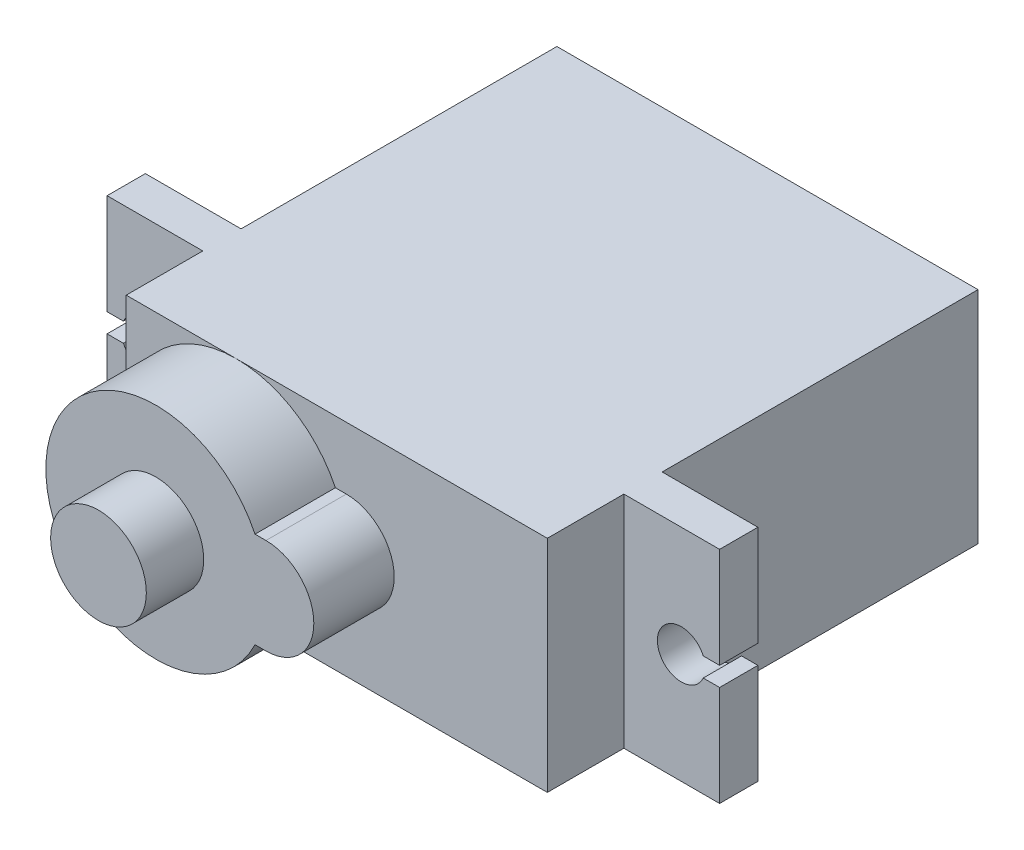
ISO-10303-21;
HEADER;
FILE_DESCRIPTION(('STEP AP214'),'2;1');
FILE_NAME('part.step','',(''),(''),'','','');
FILE_SCHEMA(('AUTOMOTIVE_DESIGN { 1 0 10303 214 1 1 1 1 }'));
ENDSEC;
DATA;
#1=APPLICATION_CONTEXT('core data for automotive mechanical design processes');
#2=APPLICATION_PROTOCOL_DEFINITION('international standard','automotive_design',2000,#1);
#3=PRODUCT_CONTEXT('',#1,'mechanical');
#4=PRODUCT('Part','Part','',(#3));
#5=PRODUCT_RELATED_PRODUCT_CATEGORY('part','',(#4));
#6=PRODUCT_DEFINITION_FORMATION('','',#4);
#7=PRODUCT_DEFINITION_CONTEXT('part definition',#1,'design');
#8=PRODUCT_DEFINITION('design','',#6,#7);
#9=PRODUCT_DEFINITION_SHAPE('','',#8);
#10=(LENGTH_UNIT() NAMED_UNIT(*) SI_UNIT(.MILLI.,.METRE.));
#11=(NAMED_UNIT(*) PLANE_ANGLE_UNIT() SI_UNIT($,.RADIAN.));
#12=(NAMED_UNIT(*) SI_UNIT($,.STERADIAN.) SOLID_ANGLE_UNIT());
#13=UNCERTAINTY_MEASURE_WITH_UNIT(LENGTH_MEASURE(1.E-05),#10,'distance_accuracy_value','');
#14=(GEOMETRIC_REPRESENTATION_CONTEXT(3) GLOBAL_UNCERTAINTY_ASSIGNED_CONTEXT((#13)) GLOBAL_UNIT_ASSIGNED_CONTEXT((#10,
#11,#12)) REPRESENTATION_CONTEXT('',''));
#15=CARTESIAN_POINT('',(0.,0.,0.));
#16=DIRECTION('',(0.,0.,1.));
#17=DIRECTION('',(1.,0.,0.));
#18=AXIS2_PLACEMENT_3D('',#15,#16,#17);
#19=CARTESIAN_POINT('',(-10.5,5.75,26.7));
#20=DIRECTION('',(0.,0.,-1.));
#21=DIRECTION('',(-1.,0.,0.));
#22=AXIS2_PLACEMENT_3D('',#19,#20,#21);
#23=PLANE('',#22);
#24=CARTESIAN_POINT('',(-10.5,5.75,26.7));
#25=DIRECTION('',(0.,0.,1.));
#26=DIRECTION('',(-1.,0.,0.));
#27=AXIS2_PLACEMENT_3D('',#24,#25,#26);
#28=CIRCLE('',#27,2.5);
#29=CARTESIAN_POINT('',(-10.5,3.25,26.7));
#30=VERTEX_POINT('',#29);
#31=CARTESIAN_POINT('',(-10.5,8.25,26.7));
#32=VERTEX_POINT('',#31);
#33=EDGE_CURVE('E218',#30,#32,#28,.T.);
#34=ORIENTED_EDGE('',*,*,#33,.T.);
#35=DIRECTION('',(-1.,0.,0.));
#36=VECTOR('',#35,1.);
#37=CARTESIAN_POINT('',(-10.5,8.25,26.7));
#38=LINE('',#37,#36);
#39=CARTESIAN_POINT('',(-11.071921205698,8.25,26.7));
#40=VERTEX_POINT('',#39);
#41=EDGE_CURVE('E207',#32,#40,#38,.T.);
#42=ORIENTED_EDGE('',*,*,#41,.T.);
#43=CARTESIAN_POINT('',(-16.25,5.75,26.7));
#44=DIRECTION('',(0.,0.,1.));
#45=DIRECTION('',(1.,0.,0.));
#46=AXIS2_PLACEMENT_3D('',#43,#44,#45);
#47=CIRCLE('',#46,5.75);
#48=CARTESIAN_POINT('',(-11.071921205698,3.25,26.7));
#49=VERTEX_POINT('',#48);
#50=EDGE_CURVE('E217',#40,#49,#47,.T.);
#51=ORIENTED_EDGE('',*,*,#50,.T.);
#52=DIRECTION('',(1.,0.,0.));
#53=VECTOR('',#52,1.);
#54=CARTESIAN_POINT('',(-10.5,3.25,26.7));
#55=LINE('',#54,#53);
#56=EDGE_CURVE('E223',#49,#30,#55,.T.);
#57=ORIENTED_EDGE('',*,*,#56,.T.);
#58=EDGE_LOOP('',(#34,#42,#51,#57));
#59=FACE_BOUND('',#58,.T.);
#60=CARTESIAN_POINT('',(-16.25,5.75,26.7));
#61=DIRECTION('',(0.,0.,-1.));
#62=DIRECTION('',(-1.,0.,0.));
#63=AXIS2_PLACEMENT_3D('',#60,#61,#62);
#64=CIRCLE('',#63,2.5);
#65=CARTESIAN_POINT('',(-18.75,5.75,26.7));
#66=VERTEX_POINT('',#65);
#67=EDGE_CURVE('E11',#66,#66,#64,.F.);
#68=ORIENTED_EDGE('',*,*,#67,.F.);
#69=EDGE_LOOP('',(#68));
#70=FACE_BOUND('',#69,.T.);
#71=ADVANCED_FACE('F39',(#59,#70),#23,.F.);
#72=CARTESIAN_POINT('',(0.,0.,22.5));
#73=DIRECTION('',(0.,0.,1.));
#74=DIRECTION('',(1.,0.,0.));
#75=AXIS2_PLACEMENT_3D('',#72,#73,#74);
#76=PLANE('',#75);
#77=CARTESIAN_POINT('',(-16.25,5.75,22.5));
#78=DIRECTION('',(0.,0.,1.));
#79=DIRECTION('',(1.,0.,0.));
#80=AXIS2_PLACEMENT_3D('',#77,#78,#79);
#81=CIRCLE('',#80,5.75);
#82=CARTESIAN_POINT('',(-22.,5.75,22.5));
#83=VERTEX_POINT('',#82);
#84=CARTESIAN_POINT('',(-16.25,0.,22.5));
#85=VERTEX_POINT('',#84);
#86=EDGE_CURVE('E47',#83,#85,#81,.T.);
#87=ORIENTED_EDGE('',*,*,#86,.F.);
#88=DIRECTION('',(0.,-1.,0.));
#89=VECTOR('',#88,1.);
#90=CARTESIAN_POINT('',(-22.,0.,22.5));
#91=LINE('',#90,#89);
#92=CARTESIAN_POINT('',(-22.,0.,22.5));
#93=VERTEX_POINT('',#92);
#94=EDGE_CURVE('E342',#83,#93,#91,.T.);
#95=ORIENTED_EDGE('',*,*,#94,.T.);
#96=DIRECTION('',(1.,0.,0.));
#97=VECTOR('',#96,1.);
#98=CARTESIAN_POINT('',(0.,0.,22.5));
#99=LINE('',#98,#97);
#100=EDGE_CURVE('E347',#93,#85,#99,.T.);
#101=ORIENTED_EDGE('',*,*,#100,.T.);
#102=EDGE_LOOP('',(#87,#95,#101));
#103=FACE_BOUND('',#102,.T.);
#104=ADVANCED_FACE('F397',(#103),#76,.T.);
#105=CARTESIAN_POINT('',(-11.071921205698,3.25,22.5));
#106=VERTEX_POINT('',#105);
#107=EDGE_CURVE('E383',#85,#106,#81,.T.);
#108=ORIENTED_EDGE('',*,*,#107,.F.);
#109=CARTESIAN_POINT('',(0.,0.,22.5));
#110=VERTEX_POINT('',#109);
#111=EDGE_CURVE('E346',#85,#110,#99,.T.);
#112=ORIENTED_EDGE('',*,*,#111,.T.);
#113=DIRECTION('',(0.,1.,0.));
#114=VECTOR('',#113,1.);
#115=CARTESIAN_POINT('',(0.,0.,22.5));
#116=LINE('',#115,#114);
#117=CARTESIAN_POINT('',(0.,11.5,22.5));
#118=VERTEX_POINT('',#117);
#119=EDGE_CURVE('E334',#110,#118,#116,.T.);
#120=ORIENTED_EDGE('',*,*,#119,.T.);
#121=DIRECTION('',(-1.,0.,0.));
#122=VECTOR('',#121,1.);
#123=CARTESIAN_POINT('',(0.,11.5,22.5));
#124=LINE('',#123,#122);
#125=CARTESIAN_POINT('',(-16.25,11.5,22.5));
#126=VERTEX_POINT('',#125);
#127=EDGE_CURVE('E339',#118,#126,#124,.T.);
#128=ORIENTED_EDGE('',*,*,#127,.T.);
#129=CARTESIAN_POINT('',(-11.071921205698,8.25,22.5));
#130=VERTEX_POINT('',#129);
#131=EDGE_CURVE('E385',#130,#126,#81,.T.);
#132=ORIENTED_EDGE('',*,*,#131,.F.);
#133=DIRECTION('',(-1.,0.,0.));
#134=VECTOR('',#133,1.);
#135=CARTESIAN_POINT('',(-10.5,8.25,22.5));
#136=LINE('',#135,#134);
#137=CARTESIAN_POINT('',(-10.5,8.25,22.5));
#138=VERTEX_POINT('',#137);
#139=EDGE_CURVE('E391',#138,#130,#136,.T.);
#140=ORIENTED_EDGE('',*,*,#139,.F.);
#141=CARTESIAN_POINT('',(-10.5,5.75,22.5));
#142=DIRECTION('',(0.,0.,1.));
#143=DIRECTION('',(-1.,0.,0.));
#144=AXIS2_PLACEMENT_3D('',#141,#142,#143);
#145=CIRCLE('',#144,2.5);
#146=CARTESIAN_POINT('',(-10.5,3.25,22.5));
#147=VERTEX_POINT('',#146);
#148=EDGE_CURVE('E59',#147,#138,#145,.T.);
#149=ORIENTED_EDGE('',*,*,#148,.F.);
#150=DIRECTION('',(1.,0.,0.));
#151=VECTOR('',#150,1.);
#152=CARTESIAN_POINT('',(-10.5,3.25,22.5));
#153=LINE('',#152,#151);
#154=EDGE_CURVE('E54',#106,#147,#153,.T.);
#155=ORIENTED_EDGE('',*,*,#154,.F.);
#156=EDGE_LOOP('',(#108,#112,#120,#128,#132,#140,#149,#155));
#157=FACE_BOUND('',#156,.T.);
#158=ADVANCED_FACE('F419',(#157),#76,.T.);
#159=CARTESIAN_POINT('',(-27.,11.5,16.5));
#160=DIRECTION('',(-1.,0.,0.));
#161=DIRECTION('',(0.,0.,1.));
#162=AXIS2_PLACEMENT_3D('',#159,#160,#161);
#163=PLANE('',#162);
#164=DIRECTION('',(0.,0.,1.));
#165=VECTOR('',#164,1.);
#166=CARTESIAN_POINT('',(-27.,5.25,0.));
#167=LINE('',#166,#165);
#168=CARTESIAN_POINT('',(-27.,5.25,16.5));
#169=VERTEX_POINT('',#168);
#170=CARTESIAN_POINT('',(-27.,5.25,18.5));
#171=VERTEX_POINT('',#170);
#172=EDGE_CURVE('E245',#169,#171,#167,.T.);
#173=ORIENTED_EDGE('',*,*,#172,.F.);
#174=DIRECTION('',(0.,-1.,0.));
#175=VECTOR('',#174,1.);
#176=CARTESIAN_POINT('',(-27.,11.5,16.5));
#177=LINE('',#176,#175);
#178=CARTESIAN_POINT('',(-27.,0.,16.5));
#179=VERTEX_POINT('',#178);
#180=EDGE_CURVE('E286',#169,#179,#177,.T.);
#181=ORIENTED_EDGE('',*,*,#180,.T.);
#182=DIRECTION('',(0.,0.,1.));
#183=VECTOR('',#182,1.);
#184=CARTESIAN_POINT('',(-27.,0.,16.5));
#185=LINE('',#184,#183);
#186=CARTESIAN_POINT('',(-27.,0.,18.5));
#187=VERTEX_POINT('',#186);
#188=EDGE_CURVE('E298',#179,#187,#185,.T.);
#189=ORIENTED_EDGE('',*,*,#188,.T.);
#190=DIRECTION('',(0.,-1.,0.));
#191=VECTOR('',#190,1.);
#192=CARTESIAN_POINT('',(-27.,11.5,18.5));
#193=LINE('',#192,#191);
#194=EDGE_CURVE('E281',#171,#187,#193,.T.);
#195=ORIENTED_EDGE('',*,*,#194,.F.);
#196=EDGE_LOOP('',(#173,#181,#189,#195));
#197=FACE_BOUND('',#196,.T.);
#198=ADVANCED_FACE('F459',(#197),#163,.T.);
#199=CARTESIAN_POINT('',(5.,11.5,16.5));
#200=DIRECTION('',(1.,0.,0.));
#201=DIRECTION('',(0.,1.,0.));
#202=AXIS2_PLACEMENT_3D('',#199,#200,#201);
#203=PLANE('',#202);
#204=DIRECTION('',(0.,0.,1.));
#205=VECTOR('',#204,1.);
#206=CARTESIAN_POINT('',(5.,6.25,16.5));
#207=LINE('',#206,#205);
#208=CARTESIAN_POINT('',(5.,6.25,16.5));
#209=VERTEX_POINT('',#208);
#210=CARTESIAN_POINT('',(5.,6.25,18.5));
#211=VERTEX_POINT('',#210);
#212=EDGE_CURVE('E377',#209,#211,#207,.T.);
#213=ORIENTED_EDGE('',*,*,#212,.F.);
#214=DIRECTION('',(0.,1.,0.));
#215=VECTOR('',#214,1.);
#216=CARTESIAN_POINT('',(5.,11.5,16.5));
#217=LINE('',#216,#215);
#218=CARTESIAN_POINT('',(5.,11.5,16.5));
#219=VERTEX_POINT('',#218);
#220=EDGE_CURVE('E290',#209,#219,#217,.T.);
#221=ORIENTED_EDGE('',*,*,#220,.T.);
#222=DIRECTION('',(0.,0.,1.));
#223=VECTOR('',#222,1.);
#224=CARTESIAN_POINT('',(5.,11.5,16.5));
#225=LINE('',#224,#223);
#226=CARTESIAN_POINT('',(5.,11.5,18.5));
#227=VERTEX_POINT('',#226);
#228=EDGE_CURVE('E316',#219,#227,#225,.T.);
#229=ORIENTED_EDGE('',*,*,#228,.T.);
#230=DIRECTION('',(0.,1.,0.));
#231=VECTOR('',#230,1.);
#232=CARTESIAN_POINT('',(5.,11.5,18.5));
#233=LINE('',#232,#231);
#234=EDGE_CURVE('E305',#211,#227,#233,.T.);
#235=ORIENTED_EDGE('',*,*,#234,.F.);
#236=EDGE_LOOP('',(#213,#221,#229,#235));
#237=FACE_BOUND('',#236,.T.);
#238=ADVANCED_FACE('F430',(#237),#203,.T.);
#239=CARTESIAN_POINT('',(0.,0.,22.5));
#240=DIRECTION('',(-1.,0.,0.));
#241=DIRECTION('',(0.,0.,1.));
#242=AXIS2_PLACEMENT_3D('',#239,#240,#241);
#243=PLANE('',#242);
#244=DIRECTION('',(0.,1.,0.));
#245=VECTOR('',#244,1.);
#246=CARTESIAN_POINT('',(0.,0.,16.5));
#247=LINE('',#246,#245);
#248=CARTESIAN_POINT('',(0.,0.,16.5));
#249=VERTEX_POINT('',#248);
#250=CARTESIAN_POINT('',(0.,11.5,16.5));
#251=VERTEX_POINT('',#250);
#252=EDGE_CURVE('E331',#249,#251,#247,.T.);
#253=ORIENTED_EDGE('',*,*,#252,.F.);
#254=DIRECTION('',(0.,0.,-1.));
#255=VECTOR('',#254,1.);
#256=CARTESIAN_POINT('',(0.,0.,22.5));
#257=LINE('',#256,#255);
#258=CARTESIAN_POINT('',(0.,0.,0.));
#259=VERTEX_POINT('',#258);
#260=EDGE_CURVE('E350',#249,#259,#257,.T.);
#261=ORIENTED_EDGE('',*,*,#260,.T.);
#262=DIRECTION('',(0.,1.,0.));
#263=VECTOR('',#262,1.);
#264=CARTESIAN_POINT('',(0.,0.,0.));
#265=LINE('',#264,#263);
#266=CARTESIAN_POINT('',(0.,11.5,0.));
#267=VERTEX_POINT('',#266);
#268=EDGE_CURVE('E333',#259,#267,#265,.T.);
#269=ORIENTED_EDGE('',*,*,#268,.T.);
#270=DIRECTION('',(0.,0.,-1.));
#271=VECTOR('',#270,1.);
#272=CARTESIAN_POINT('',(0.,11.5,22.5));
#273=LINE('',#272,#271);
#274=EDGE_CURVE('E372',#251,#267,#273,.T.);
#275=ORIENTED_EDGE('',*,*,#274,.F.);
#276=EDGE_LOOP('',(#253,#261,#269,#275));
#277=FACE_BOUND('',#276,.T.);
#278=ADVANCED_FACE('F438',(#277),#243,.F.);
#279=CARTESIAN_POINT('',(-22.,0.,22.5));
#280=DIRECTION('',(1.,0.,0.));
#281=DIRECTION('',(0.,1.,0.));
#282=AXIS2_PLACEMENT_3D('',#279,#280,#281);
#283=PLANE('',#282);
#284=DIRECTION('',(0.,-1.,0.));
#285=VECTOR('',#284,1.);
#286=CARTESIAN_POINT('',(-22.,0.,16.5));
#287=LINE('',#286,#285);
#288=CARTESIAN_POINT('',(-22.,11.5,16.5));
#289=VERTEX_POINT('',#288);
#290=CARTESIAN_POINT('',(-22.,0.,16.5));
#291=VERTEX_POINT('',#290);
#292=EDGE_CURVE('E329',#289,#291,#287,.T.);
#293=ORIENTED_EDGE('',*,*,#292,.F.);
#294=DIRECTION('',(0.,0.,-1.));
#295=VECTOR('',#294,1.);
#296=CARTESIAN_POINT('',(-22.,11.5,22.5));
#297=LINE('',#296,#295);
#298=CARTESIAN_POINT('',(-22.,11.5,0.));
#299=VERTEX_POINT('',#298);
#300=EDGE_CURVE('E368',#289,#299,#297,.T.);
#301=ORIENTED_EDGE('',*,*,#300,.T.);
#302=DIRECTION('',(0.,-1.,0.));
#303=VECTOR('',#302,1.);
#304=CARTESIAN_POINT('',(-22.,0.,0.));
#305=LINE('',#304,#303);
#306=CARTESIAN_POINT('',(-22.,0.,0.));
#307=VERTEX_POINT('',#306);
#308=EDGE_CURVE('E356',#299,#307,#305,.T.);
#309=ORIENTED_EDGE('',*,*,#308,.T.);
#310=DIRECTION('',(0.,0.,-1.));
#311=VECTOR('',#310,1.);
#312=CARTESIAN_POINT('',(-22.,0.,22.5));
#313=LINE('',#312,#311);
#314=EDGE_CURVE('E364',#291,#307,#313,.T.);
#315=ORIENTED_EDGE('',*,*,#314,.F.);
#316=EDGE_LOOP('',(#293,#301,#309,#315));
#317=FACE_BOUND('',#316,.T.);
#318=ADVANCED_FACE('F449',(#317),#283,.F.);
#319=CARTESIAN_POINT('',(0.,0.,18.5));
#320=VERTEX_POINT('',#319);
#321=EDGE_CURVE('E361',#110,#320,#257,.T.);
#322=ORIENTED_EDGE('',*,*,#321,.T.);
#323=DIRECTION('',(0.,1.,0.));
#324=VECTOR('',#323,1.);
#325=CARTESIAN_POINT('',(0.,0.,18.5));
#326=LINE('',#325,#324);
#327=CARTESIAN_POINT('',(0.,11.5,18.5));
#328=VERTEX_POINT('',#327);
#329=EDGE_CURVE('E326',#320,#328,#326,.T.);
#330=ORIENTED_EDGE('',*,*,#329,.T.);
#331=EDGE_CURVE('E373',#118,#328,#273,.T.);
#332=ORIENTED_EDGE('',*,*,#331,.F.);
#333=ORIENTED_EDGE('',*,*,#119,.F.);
#334=EDGE_LOOP('',(#322,#330,#332,#333));
#335=FACE_BOUND('',#334,.T.);
#336=ADVANCED_FACE('F41',(#335),#243,.F.);
#337=CARTESIAN_POINT('',(0.,11.5,22.5));
#338=DIRECTION('',(0.,-1.,0.));
#339=DIRECTION('',(1.,0.,0.));
#340=AXIS2_PLACEMENT_3D('',#337,#338,#339);
#341=PLANE('',#340);
#342=ORIENTED_EDGE('',*,*,#331,.T.);
#343=DIRECTION('',(-1.,0.,0.));
#344=VECTOR('',#343,1.);
#345=CARTESIAN_POINT('',(-27.,11.5,18.5));
#346=LINE('',#345,#344);
#347=EDGE_CURVE('E310',#227,#328,#346,.T.);
#348=ORIENTED_EDGE('',*,*,#347,.F.);
#349=ORIENTED_EDGE('',*,*,#228,.F.);
#350=DIRECTION('',(-1.,0.,0.));
#351=VECTOR('',#350,1.);
#352=CARTESIAN_POINT('',(-27.,11.5,16.5));
#353=LINE('',#352,#351);
#354=EDGE_CURVE('E295',#219,#251,#353,.T.);
#355=ORIENTED_EDGE('',*,*,#354,.T.);
#356=ORIENTED_EDGE('',*,*,#274,.T.);
#357=DIRECTION('',(-1.,0.,0.));
#358=VECTOR('',#357,1.);
#359=CARTESIAN_POINT('',(0.,11.5,0.));
#360=LINE('',#359,#358);
#361=EDGE_CURVE('E353',#267,#299,#360,.T.);
#362=ORIENTED_EDGE('',*,*,#361,.T.);
#363=ORIENTED_EDGE('',*,*,#300,.F.);
#364=CARTESIAN_POINT('',(-27.,11.5,16.5));
#365=VERTEX_POINT('',#364);
#366=EDGE_CURVE('E294',#289,#365,#353,.T.);
#367=ORIENTED_EDGE('',*,*,#366,.T.);
#368=DIRECTION('',(0.,0.,1.));
#369=VECTOR('',#368,1.);
#370=CARTESIAN_POINT('',(-27.,11.5,16.5));
#371=LINE('',#370,#369);
#372=CARTESIAN_POINT('',(-27.,11.5,18.5));
#373=VERTEX_POINT('',#372);
#374=EDGE_CURVE('E312',#365,#373,#371,.T.);
#375=ORIENTED_EDGE('',*,*,#374,.T.);
#376=CARTESIAN_POINT('',(-22.,11.5,18.5));
#377=VERTEX_POINT('',#376);
#378=EDGE_CURVE('E309',#377,#373,#346,.T.);
#379=ORIENTED_EDGE('',*,*,#378,.F.);
#380=CARTESIAN_POINT('',(-22.,11.5,22.5));
#381=VERTEX_POINT('',#380);
#382=EDGE_CURVE('E369',#381,#377,#297,.T.);
#383=ORIENTED_EDGE('',*,*,#382,.F.);
#384=EDGE_CURVE('E337',#126,#381,#124,.T.);
#385=ORIENTED_EDGE('',*,*,#384,.F.);
#386=ORIENTED_EDGE('',*,*,#127,.F.);
#387=EDGE_LOOP('',(#342,#348,#349,#355,#356,#362,#363,#367,#375,#379,#383,#385,#386));
#388=FACE_BOUND('',#387,.T.);
#389=ADVANCED_FACE('F409',(#388),#341,.F.);
#390=ORIENTED_EDGE('',*,*,#382,.T.);
#391=DIRECTION('',(0.,-1.,0.));
#392=VECTOR('',#391,1.);
#393=CARTESIAN_POINT('',(-22.,0.,18.5));
#394=LINE('',#393,#392);
#395=CARTESIAN_POINT('',(-22.,0.,18.5));
#396=VERTEX_POINT('',#395);
#397=EDGE_CURVE('E315',#377,#396,#394,.T.);
#398=ORIENTED_EDGE('',*,*,#397,.T.);
#399=EDGE_CURVE('E365',#93,#396,#313,.T.);
#400=ORIENTED_EDGE('',*,*,#399,.F.);
#401=ORIENTED_EDGE('',*,*,#94,.F.);
#402=EDGE_CURVE('E343',#381,#83,#91,.T.);
#403=ORIENTED_EDGE('',*,*,#402,.F.);
#404=EDGE_LOOP('',(#390,#398,#400,#401,#403));
#405=FACE_BOUND('',#404,.T.);
#406=ADVANCED_FACE('F402',(#405),#283,.F.);
#407=CARTESIAN_POINT('',(0.,0.,22.5));
#408=DIRECTION('',(0.,1.,0.));
#409=DIRECTION('',(-1.,0.,0.));
#410=AXIS2_PLACEMENT_3D('',#407,#408,#409);
#411=PLANE('',#410);
#412=ORIENTED_EDGE('',*,*,#399,.T.);
#413=DIRECTION('',(1.,0.,0.));
#414=VECTOR('',#413,1.);
#415=CARTESIAN_POINT('',(-27.,0.,18.5));
#416=LINE('',#415,#414);
#417=EDGE_CURVE('E303',#187,#396,#416,.T.);
#418=ORIENTED_EDGE('',*,*,#417,.F.);
#419=ORIENTED_EDGE('',*,*,#188,.F.);
#420=DIRECTION('',(1.,0.,0.));
#421=VECTOR('',#420,1.);
#422=CARTESIAN_POINT('',(-27.,0.,16.5));
#423=LINE('',#422,#421);
#424=EDGE_CURVE('E287',#179,#291,#423,.T.);
#425=ORIENTED_EDGE('',*,*,#424,.T.);
#426=ORIENTED_EDGE('',*,*,#314,.T.);
#427=DIRECTION('',(1.,0.,0.));
#428=VECTOR('',#427,1.);
#429=CARTESIAN_POINT('',(0.,0.,0.));
#430=LINE('',#429,#428);
#431=EDGE_CURVE('E338',#307,#259,#430,.T.);
#432=ORIENTED_EDGE('',*,*,#431,.T.);
#433=ORIENTED_EDGE('',*,*,#260,.F.);
#434=CARTESIAN_POINT('',(5.,0.,16.5));
#435=VERTEX_POINT('',#434);
#436=EDGE_CURVE('E285',#249,#435,#423,.T.);
#437=ORIENTED_EDGE('',*,*,#436,.T.);
#438=DIRECTION('',(0.,0.,1.));
#439=VECTOR('',#438,1.);
#440=CARTESIAN_POINT('',(5.,0.,16.5));
#441=LINE('',#440,#439);
#442=CARTESIAN_POINT('',(5.,0.,18.5));
#443=VERTEX_POINT('',#442);
#444=EDGE_CURVE('E319',#435,#443,#441,.T.);
#445=ORIENTED_EDGE('',*,*,#444,.T.);
#446=EDGE_CURVE('E302',#320,#443,#416,.T.);
#447=ORIENTED_EDGE('',*,*,#446,.F.);
#448=ORIENTED_EDGE('',*,*,#321,.F.);
#449=ORIENTED_EDGE('',*,*,#111,.F.);
#450=ORIENTED_EDGE('',*,*,#100,.F.);
#451=EDGE_LOOP('',(#412,#418,#419,#425,#426,#432,#433,#437,#445,#447,#448,#449,#450));
#452=FACE_BOUND('',#451,.T.);
#453=ADVANCED_FACE('F413',(#452),#411,.F.);
#454=EDGE_CURVE('E378',#126,#83,#81,.T.);
#455=ORIENTED_EDGE('',*,*,#454,.F.);
#456=ORIENTED_EDGE('',*,*,#384,.T.);
#457=ORIENTED_EDGE('',*,*,#402,.T.);
#458=EDGE_LOOP('',(#455,#456,#457));
#459=FACE_BOUND('',#458,.T.);
#460=ADVANCED_FACE('F404',(#459),#76,.T.);
#461=CARTESIAN_POINT('',(0.,0.,0.));
#462=DIRECTION('',(0.,0.,1.));
#463=DIRECTION('',(1.,0.,0.));
#464=AXIS2_PLACEMENT_3D('',#461,#462,#463);
#465=PLANE('',#464);
#466=ORIENTED_EDGE('',*,*,#268,.F.);
#467=ORIENTED_EDGE('',*,*,#431,.F.);
#468=ORIENTED_EDGE('',*,*,#308,.F.);
#469=ORIENTED_EDGE('',*,*,#361,.F.);
#470=EDGE_LOOP('',(#466,#467,#468,#469));
#471=FACE_BOUND('',#470,.T.);
#472=ADVANCED_FACE('F443',(#471),#465,.F.);
#473=DIRECTION('',(0.,0.,1.));
#474=VECTOR('',#473,1.);
#475=CARTESIAN_POINT('',(-27.,6.25,0.));
#476=LINE('',#475,#474);
#477=CARTESIAN_POINT('',(-27.,6.25,16.5));
#478=VERTEX_POINT('',#477);
#479=CARTESIAN_POINT('',(-27.,6.25,18.5));
#480=VERTEX_POINT('',#479);
#481=EDGE_CURVE('E247',#478,#480,#476,.T.);
#482=ORIENTED_EDGE('',*,*,#481,.T.);
#483=EDGE_CURVE('E299',#373,#480,#193,.T.);
#484=ORIENTED_EDGE('',*,*,#483,.F.);
#485=ORIENTED_EDGE('',*,*,#374,.F.);
#486=EDGE_CURVE('E282',#365,#478,#177,.T.);
#487=ORIENTED_EDGE('',*,*,#486,.T.);
#488=EDGE_LOOP('',(#482,#484,#485,#487));
#489=FACE_BOUND('',#488,.T.);
#490=ADVANCED_FACE('F474',(#489),#163,.T.);
#491=CARTESIAN_POINT('',(0.,0.,16.5));
#492=DIRECTION('',(0.,0.,1.));
#493=DIRECTION('',(1.,0.,0.));
#494=AXIS2_PLACEMENT_3D('',#491,#492,#493);
#495=PLANE('',#494);
#496=ORIENTED_EDGE('',*,*,#180,.F.);
#497=DIRECTION('',(1.,0.,0.));
#498=VECTOR('',#497,1.);
#499=CARTESIAN_POINT('',(0.,5.24999999999997,16.5));
#500=LINE('',#499,#498);
#501=CARTESIAN_POINT('',(-26.145643923739,5.25,16.5));
#502=VERTEX_POINT('',#501);
#503=EDGE_CURVE('E254',#169,#502,#500,.T.);
#504=ORIENTED_EDGE('',*,*,#503,.T.);
#505=CARTESIAN_POINT('',(-25.,5.75,16.5));
#506=DIRECTION('',(0.,0.,1.));
#507=DIRECTION('',(1.,0.,0.));
#508=AXIS2_PLACEMENT_3D('',#505,#506,#507);
#509=CIRCLE('',#508,1.25);
#510=CARTESIAN_POINT('',(-26.145643923739,6.25,16.5));
#511=VERTEX_POINT('',#510);
#512=EDGE_CURVE('E257',#502,#511,#509,.T.);
#513=ORIENTED_EDGE('',*,*,#512,.T.);
#514=DIRECTION('',(-1.,0.,0.));
#515=VECTOR('',#514,1.);
#516=CARTESIAN_POINT('',(0.,6.25000000000003,16.5));
#517=LINE('',#516,#515);
#518=EDGE_CURVE('E244',#511,#478,#517,.T.);
#519=ORIENTED_EDGE('',*,*,#518,.T.);
#520=ORIENTED_EDGE('',*,*,#486,.F.);
#521=ORIENTED_EDGE('',*,*,#366,.F.);
#522=ORIENTED_EDGE('',*,*,#292,.T.);
#523=ORIENTED_EDGE('',*,*,#424,.F.);
#524=EDGE_LOOP('',(#496,#504,#513,#519,#520,#521,#522,#523));
#525=FACE_BOUND('',#524,.T.);
#526=ADVANCED_FACE('F454',(#525),#495,.F.);
#527=CARTESIAN_POINT('',(0.,0.,18.5));
#528=DIRECTION('',(0.,0.,1.));
#529=DIRECTION('',(1.,0.,0.));
#530=AXIS2_PLACEMENT_3D('',#527,#528,#529);
#531=PLANE('',#530);
#532=DIRECTION('',(1.,0.,0.));
#533=VECTOR('',#532,1.);
#534=CARTESIAN_POINT('',(-26.145643923739,5.25,18.5));
#535=LINE('',#534,#533);
#536=CARTESIAN_POINT('',(-26.145643923739,5.25,18.5));
#537=VERTEX_POINT('',#536);
#538=EDGE_CURVE('E238',#171,#537,#535,.T.);
#539=ORIENTED_EDGE('',*,*,#538,.F.);
#540=ORIENTED_EDGE('',*,*,#194,.T.);
#541=ORIENTED_EDGE('',*,*,#417,.T.);
#542=ORIENTED_EDGE('',*,*,#397,.F.);
#543=ORIENTED_EDGE('',*,*,#378,.T.);
#544=ORIENTED_EDGE('',*,*,#483,.T.);
#545=DIRECTION('',(-1.,0.,0.));
#546=VECTOR('',#545,1.);
#547=CARTESIAN_POINT('',(-26.145643923739,6.25,18.5));
#548=LINE('',#547,#546);
#549=CARTESIAN_POINT('',(-26.145643923739,6.25,18.5));
#550=VERTEX_POINT('',#549);
#551=EDGE_CURVE('E231',#550,#480,#548,.T.);
#552=ORIENTED_EDGE('',*,*,#551,.F.);
#553=CARTESIAN_POINT('',(-25.,5.75,18.5));
#554=DIRECTION('',(0.,0.,1.));
#555=DIRECTION('',(-1.,0.,0.));
#556=AXIS2_PLACEMENT_3D('',#553,#554,#555);
#557=CIRCLE('',#556,1.25);
#558=EDGE_CURVE('E229',#537,#550,#557,.T.);
#559=ORIENTED_EDGE('',*,*,#558,.F.);
#560=EDGE_LOOP('',(#539,#540,#541,#542,#543,#544,#552,#559));
#561=FACE_BOUND('',#560,.T.);
#562=ADVANCED_FACE('F471',(#561),#531,.T.);
#563=ORIENTED_EDGE('',*,*,#220,.F.);
#564=DIRECTION('',(-1.,0.,0.));
#565=VECTOR('',#564,1.);
#566=CARTESIAN_POINT('',(0.,6.25000000000001,16.5));
#567=LINE('',#566,#565);
#568=CARTESIAN_POINT('',(4.14564392373896,6.25,16.5));
#569=VERTEX_POINT('',#568);
#570=EDGE_CURVE('E275',#209,#569,#567,.T.);
#571=ORIENTED_EDGE('',*,*,#570,.T.);
#572=CARTESIAN_POINT('',(3.,5.75,16.5));
#573=DIRECTION('',(0.,0.,1.));
#574=DIRECTION('',(1.,0.,0.));
#575=AXIS2_PLACEMENT_3D('',#572,#573,#574);
#576=CIRCLE('',#575,1.25);
#577=CARTESIAN_POINT('',(4.14564392373896,5.25,16.5));
#578=VERTEX_POINT('',#577);
#579=EDGE_CURVE('E278',#569,#578,#576,.T.);
#580=ORIENTED_EDGE('',*,*,#579,.T.);
#581=DIRECTION('',(1.,0.,0.));
#582=VECTOR('',#581,1.);
#583=CARTESIAN_POINT('',(0.,5.25,16.5));
#584=LINE('',#583,#582);
#585=CARTESIAN_POINT('',(5.,5.25,16.5));
#586=VERTEX_POINT('',#585);
#587=EDGE_CURVE('E271',#578,#586,#584,.T.);
#588=ORIENTED_EDGE('',*,*,#587,.T.);
#589=EDGE_CURVE('E291',#435,#586,#217,.T.);
#590=ORIENTED_EDGE('',*,*,#589,.F.);
#591=ORIENTED_EDGE('',*,*,#436,.F.);
#592=ORIENTED_EDGE('',*,*,#252,.T.);
#593=ORIENTED_EDGE('',*,*,#354,.F.);
#594=EDGE_LOOP('',(#563,#571,#580,#588,#590,#591,#592,#593));
#595=FACE_BOUND('',#594,.T.);
#596=ADVANCED_FACE('F433',(#595),#495,.F.);
#597=DIRECTION('',(-1.,0.,0.));
#598=VECTOR('',#597,1.);
#599=CARTESIAN_POINT('',(4.14564392373896,6.25,18.5));
#600=LINE('',#599,#598);
#601=CARTESIAN_POINT('',(4.14564392373896,6.25,18.5));
#602=VERTEX_POINT('',#601);
#603=EDGE_CURVE('E265',#211,#602,#600,.T.);
#604=ORIENTED_EDGE('',*,*,#603,.F.);
#605=ORIENTED_EDGE('',*,*,#234,.T.);
#606=ORIENTED_EDGE('',*,*,#347,.T.);
#607=ORIENTED_EDGE('',*,*,#329,.F.);
#608=ORIENTED_EDGE('',*,*,#446,.T.);
#609=CARTESIAN_POINT('',(5.,5.25,18.5));
#610=VERTEX_POINT('',#609);
#611=EDGE_CURVE('E306',#443,#610,#233,.T.);
#612=ORIENTED_EDGE('',*,*,#611,.T.);
#613=DIRECTION('',(1.,0.,0.));
#614=VECTOR('',#613,1.);
#615=CARTESIAN_POINT('',(4.14564392373896,5.25,18.5));
#616=LINE('',#615,#614);
#617=CARTESIAN_POINT('',(4.14564392373896,5.25,18.5));
#618=VERTEX_POINT('',#617);
#619=EDGE_CURVE('E263',#618,#610,#616,.T.);
#620=ORIENTED_EDGE('',*,*,#619,.F.);
#621=CARTESIAN_POINT('',(3.,5.75,18.5));
#622=DIRECTION('',(0.,0.,1.));
#623=DIRECTION('',(1.,0.,0.));
#624=AXIS2_PLACEMENT_3D('',#621,#622,#623);
#625=CIRCLE('',#624,1.25);
#626=EDGE_CURVE('E260',#602,#618,#625,.T.);
#627=ORIENTED_EDGE('',*,*,#626,.F.);
#628=EDGE_LOOP('',(#604,#605,#606,#607,#608,#612,#620,#627));
#629=FACE_BOUND('',#628,.T.);
#630=ADVANCED_FACE('F426',(#629),#531,.T.);
#631=DIRECTION('',(0.,0.,-1.));
#632=VECTOR('',#631,1.);
#633=CARTESIAN_POINT('',(5.,5.25,16.5));
#634=LINE('',#633,#632);
#635=EDGE_CURVE('E376',#610,#586,#634,.T.);
#636=ORIENTED_EDGE('',*,*,#635,.F.);
#637=ORIENTED_EDGE('',*,*,#611,.F.);
#638=ORIENTED_EDGE('',*,*,#444,.F.);
#639=ORIENTED_EDGE('',*,*,#589,.T.);
#640=EDGE_LOOP('',(#636,#637,#638,#639));
#641=FACE_BOUND('',#640,.T.);
#642=ADVANCED_FACE('F520',(#641),#203,.T.);
#643=CARTESIAN_POINT('',(3.,5.75,0.));
#644=DIRECTION('',(0.,0.,1.));
#645=DIRECTION('',(1.,0.,0.));
#646=AXIS2_PLACEMENT_3D('',#643,#644,#645);
#647=CYLINDRICAL_SURFACE('',#646,1.25);
#648=DIRECTION('',(0.,0.,1.));
#649=VECTOR('',#648,1.);
#650=CARTESIAN_POINT('',(4.14564392373896,6.25,0.));
#651=LINE('',#650,#649);
#652=EDGE_CURVE('E269',#569,#602,#651,.T.);
#653=ORIENTED_EDGE('',*,*,#652,.T.);
#654=ORIENTED_EDGE('',*,*,#626,.T.);
#655=DIRECTION('',(0.,0.,1.));
#656=VECTOR('',#655,1.);
#657=CARTESIAN_POINT('',(4.14564392373896,5.25,0.));
#658=LINE('',#657,#656);
#659=EDGE_CURVE('E268',#578,#618,#658,.T.);
#660=ORIENTED_EDGE('',*,*,#659,.F.);
#661=ORIENTED_EDGE('',*,*,#579,.F.);
#662=EDGE_LOOP('',(#653,#654,#660,#661));
#663=FACE_BOUND('',#662,.T.);
#664=ADVANCED_FACE('F515',(#663),#647,.F.);
#665=CARTESIAN_POINT('',(4.14564392373896,6.25,0.));
#666=DIRECTION('',(0.,1.,0.));
#667=DIRECTION('',(-1.,0.,0.));
#668=AXIS2_PLACEMENT_3D('',#665,#666,#667);
#669=PLANE('',#668);
#670=ORIENTED_EDGE('',*,*,#212,.T.);
#671=ORIENTED_EDGE('',*,*,#603,.T.);
#672=ORIENTED_EDGE('',*,*,#652,.F.);
#673=ORIENTED_EDGE('',*,*,#570,.F.);
#674=EDGE_LOOP('',(#670,#671,#672,#673));
#675=FACE_BOUND('',#674,.T.);
#676=ADVANCED_FACE('F512',(#675),#669,.F.);
#677=CARTESIAN_POINT('',(4.14564392373896,5.25,0.));
#678=DIRECTION('',(0.,-1.,0.));
#679=DIRECTION('',(1.,0.,0.));
#680=AXIS2_PLACEMENT_3D('',#677,#678,#679);
#681=PLANE('',#680);
#682=ORIENTED_EDGE('',*,*,#659,.T.);
#683=ORIENTED_EDGE('',*,*,#619,.T.);
#684=ORIENTED_EDGE('',*,*,#635,.T.);
#685=ORIENTED_EDGE('',*,*,#587,.F.);
#686=EDGE_LOOP('',(#682,#683,#684,#685));
#687=FACE_BOUND('',#686,.T.);
#688=ADVANCED_FACE('F511',(#687),#681,.F.);
#689=CARTESIAN_POINT('',(-25.,5.75,0.));
#690=DIRECTION('',(0.,0.,1.));
#691=DIRECTION('',(1.,0.,0.));
#692=AXIS2_PLACEMENT_3D('',#689,#690,#691);
#693=CYLINDRICAL_SURFACE('',#692,1.25);
#694=DIRECTION('',(0.,0.,1.));
#695=VECTOR('',#694,1.);
#696=CARTESIAN_POINT('',(-26.145643923739,5.25,0.));
#697=LINE('',#696,#695);
#698=EDGE_CURVE('E242',#502,#537,#697,.T.);
#699=ORIENTED_EDGE('',*,*,#698,.T.);
#700=ORIENTED_EDGE('',*,*,#558,.T.);
#701=DIRECTION('',(0.,0.,1.));
#702=VECTOR('',#701,1.);
#703=CARTESIAN_POINT('',(-26.145643923739,6.25,0.));
#704=LINE('',#703,#702);
#705=EDGE_CURVE('E241',#511,#550,#704,.T.);
#706=ORIENTED_EDGE('',*,*,#705,.F.);
#707=ORIENTED_EDGE('',*,*,#512,.F.);
#708=EDGE_LOOP('',(#699,#700,#706,#707));
#709=FACE_BOUND('',#708,.T.);
#710=ADVANCED_FACE('F466',(#709),#693,.F.);
#711=CARTESIAN_POINT('',(-26.145643923739,5.25,0.));
#712=DIRECTION('',(0.,-1.,0.));
#713=DIRECTION('',(1.,0.,0.));
#714=AXIS2_PLACEMENT_3D('',#711,#712,#713);
#715=PLANE('',#714);
#716=ORIENTED_EDGE('',*,*,#172,.T.);
#717=ORIENTED_EDGE('',*,*,#538,.T.);
#718=ORIENTED_EDGE('',*,*,#698,.F.);
#719=ORIENTED_EDGE('',*,*,#503,.F.);
#720=EDGE_LOOP('',(#716,#717,#718,#719));
#721=FACE_BOUND('',#720,.T.);
#722=ADVANCED_FACE('F462',(#721),#715,.F.);
#723=CARTESIAN_POINT('',(-26.145643923739,6.25,0.));
#724=DIRECTION('',(0.,1.,0.));
#725=DIRECTION('',(-1.,0.,0.));
#726=AXIS2_PLACEMENT_3D('',#723,#724,#725);
#727=PLANE('',#726);
#728=ORIENTED_EDGE('',*,*,#705,.T.);
#729=ORIENTED_EDGE('',*,*,#551,.T.);
#730=ORIENTED_EDGE('',*,*,#481,.F.);
#731=ORIENTED_EDGE('',*,*,#518,.F.);
#732=EDGE_LOOP('',(#728,#729,#730,#731));
#733=FACE_BOUND('',#732,.T.);
#734=ADVANCED_FACE('F470',(#733),#727,.F.);
#735=CARTESIAN_POINT('',(-10.5,5.75,26.7));
#736=DIRECTION('',(0.,0.,-1.));
#737=DIRECTION('',(-1.,0.,0.));
#738=AXIS2_PLACEMENT_3D('',#735,#736,#737);
#739=CYLINDRICAL_SURFACE('',#738,2.5);
#740=ORIENTED_EDGE('',*,*,#148,.T.);
#741=DIRECTION('',(0.,0.,-1.));
#742=VECTOR('',#741,1.);
#743=CARTESIAN_POINT('',(-10.5,8.25,26.7));
#744=LINE('',#743,#742);
#745=EDGE_CURVE('E212',#32,#138,#744,.T.);
#746=ORIENTED_EDGE('',*,*,#745,.F.);
#747=ORIENTED_EDGE('',*,*,#33,.F.);
#748=DIRECTION('',(0.,0.,-1.));
#749=VECTOR('',#748,1.);
#750=CARTESIAN_POINT('',(-10.5,3.25,26.7));
#751=LINE('',#750,#749);
#752=EDGE_CURVE('E713',#30,#147,#751,.T.);
#753=ORIENTED_EDGE('',*,*,#752,.T.);
#754=EDGE_LOOP('',(#740,#746,#747,#753));
#755=FACE_BOUND('',#754,.T.);
#756=ADVANCED_FACE('F228',(#755),#739,.T.);
#757=CARTESIAN_POINT('',(-10.5,8.25,26.7));
#758=DIRECTION('',(0.,-1.,0.));
#759=DIRECTION('',(0.,0.,-1.));
#760=AXIS2_PLACEMENT_3D('',#757,#758,#759);
#761=PLANE('',#760);
#762=ORIENTED_EDGE('',*,*,#139,.T.);
#763=DIRECTION('',(0.,0.,-1.));
#764=VECTOR('',#763,1.);
#765=CARTESIAN_POINT('',(-11.071921205698,8.25,26.7));
#766=LINE('',#765,#764);
#767=EDGE_CURVE('E214',#40,#130,#766,.T.);
#768=ORIENTED_EDGE('',*,*,#767,.F.);
#769=ORIENTED_EDGE('',*,*,#41,.F.);
#770=ORIENTED_EDGE('',*,*,#745,.T.);
#771=EDGE_LOOP('',(#762,#768,#769,#770));
#772=FACE_BOUND('',#771,.T.);
#773=ADVANCED_FACE('F210',(#772),#761,.F.);
#774=CARTESIAN_POINT('',(-16.25,5.75,26.7));
#775=DIRECTION('',(0.,0.,-1.));
#776=DIRECTION('',(-1.,0.,0.));
#777=AXIS2_PLACEMENT_3D('',#774,#775,#776);
#778=CYLINDRICAL_SURFACE('',#777,5.75);
#779=ORIENTED_EDGE('',*,*,#131,.T.);
#780=ORIENTED_EDGE('',*,*,#454,.T.);
#781=ORIENTED_EDGE('',*,*,#86,.T.);
#782=ORIENTED_EDGE('',*,*,#107,.T.);
#783=DIRECTION('',(0.,0.,-1.));
#784=VECTOR('',#783,1.);
#785=CARTESIAN_POINT('',(-11.071921205698,3.25,26.7));
#786=LINE('',#785,#784);
#787=EDGE_CURVE('E233',#49,#106,#786,.T.);
#788=ORIENTED_EDGE('',*,*,#787,.F.);
#789=ORIENTED_EDGE('',*,*,#50,.F.);
#790=ORIENTED_EDGE('',*,*,#767,.T.);
#791=EDGE_LOOP('',(#779,#780,#781,#782,#788,#789,#790));
#792=FACE_BOUND('',#791,.T.);
#793=ADVANCED_FACE('F392',(#792),#778,.T.);
#794=CARTESIAN_POINT('',(-10.5,3.25,26.7));
#795=DIRECTION('',(0.,1.,0.));
#796=DIRECTION('',(-1.,0.,0.));
#797=AXIS2_PLACEMENT_3D('',#794,#795,#796);
#798=PLANE('',#797);
#799=ORIENTED_EDGE('',*,*,#154,.T.);
#800=ORIENTED_EDGE('',*,*,#752,.F.);
#801=ORIENTED_EDGE('',*,*,#56,.F.);
#802=ORIENTED_EDGE('',*,*,#787,.T.);
#803=EDGE_LOOP('',(#799,#800,#801,#802));
#804=FACE_BOUND('',#803,.T.);
#805=ADVANCED_FACE('F495',(#804),#798,.F.);
#806=CARTESIAN_POINT('',(-16.25,5.75,29.7));
#807=DIRECTION('',(0.,0.,-1.));
#808=DIRECTION('',(-1.,0.,0.));
#809=AXIS2_PLACEMENT_3D('',#806,#807,#808);
#810=CYLINDRICAL_SURFACE('',#809,2.5);
#811=CARTESIAN_POINT('',(-16.25,5.75,29.7));
#812=DIRECTION('',(0.,0.,1.));
#813=DIRECTION('',(1.,0.,0.));
#814=AXIS2_PLACEMENT_3D('',#811,#812,#813);
#815=CIRCLE('',#814,2.5);
#816=CARTESIAN_POINT('',(-13.75,5.75,29.7));
#817=VERTEX_POINT('',#816);
#818=EDGE_CURVE('E708',#817,#817,#815,.T.);
#819=ORIENTED_EDGE('',*,*,#818,.F.);
#820=EDGE_LOOP('',(#819));
#821=FACE_BOUND('',#820,.T.);
#822=ORIENTED_EDGE('',*,*,#67,.T.);
#823=EDGE_LOOP('',(#822));
#824=FACE_BOUND('',#823,.T.);
#825=ADVANCED_FACE('F493',(#821,#824),#810,.T.);
#826=CARTESIAN_POINT('',(-16.25,5.75,29.7));
#827=DIRECTION('',(0.,0.,1.));
#828=DIRECTION('',(1.,0.,0.));
#829=AXIS2_PLACEMENT_3D('',#826,#827,#828);
#830=PLANE('',#829);
#831=ORIENTED_EDGE('',*,*,#818,.T.);
#832=EDGE_LOOP('',(#831));
#833=FACE_BOUND('',#832,.T.);
#834=ADVANCED_FACE('F676',(#833),#830,.T.);
#835=CLOSED_SHELL('',(#71,#104,#158,#198,#238,#278,#318,#336,#389,#406,#453,#460,#472,#490,#526,
#562,#596,#630,#642,#664,#676,#688,#710,#722,#734,#756,#773,#793,#805,#825,#834));
#836=MANIFOLD_SOLID_BREP('B2',#835);
#837=ADVANCED_BREP_SHAPE_REPRESENTATION('',(#18,#836),#14);
#838=SHAPE_DEFINITION_REPRESENTATION(#9,#837);
ENDSEC;
END-ISO-10303-21;
